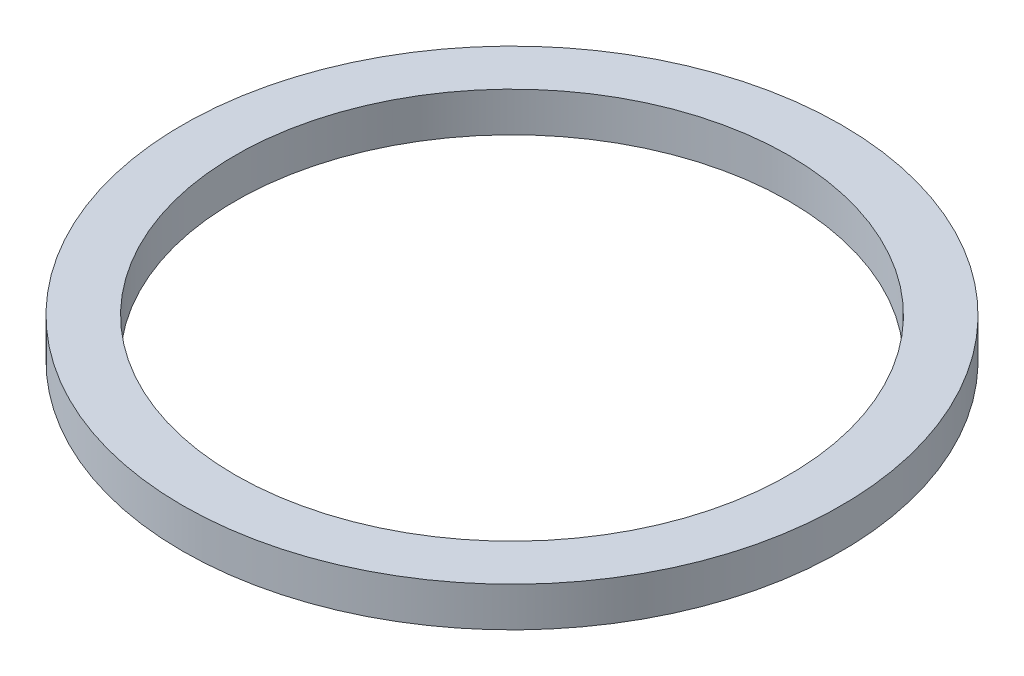
ISO-10303-21;
HEADER;
FILE_DESCRIPTION(('STEP AP214'),'2;1');
FILE_NAME('part.step','',(''),(''),'','','');
FILE_SCHEMA(('AUTOMOTIVE_DESIGN { 1 0 10303 214 1 1 1 1 }'));
ENDSEC;
DATA;
#1=APPLICATION_CONTEXT('core data for automotive mechanical design processes');
#2=APPLICATION_PROTOCOL_DEFINITION('international standard','automotive_design',2000,#1);
#3=PRODUCT_CONTEXT('',#1,'mechanical');
#4=PRODUCT('Part','Part','',(#3));
#5=PRODUCT_RELATED_PRODUCT_CATEGORY('part','',(#4));
#6=PRODUCT_DEFINITION_FORMATION('','',#4);
#7=PRODUCT_DEFINITION_CONTEXT('part definition',#1,'design');
#8=PRODUCT_DEFINITION('design','',#6,#7);
#9=PRODUCT_DEFINITION_SHAPE('','',#8);
#10=(LENGTH_UNIT() NAMED_UNIT(*) SI_UNIT(.MILLI.,.METRE.));
#11=(NAMED_UNIT(*) PLANE_ANGLE_UNIT() SI_UNIT($,.RADIAN.));
#12=(NAMED_UNIT(*) SI_UNIT($,.STERADIAN.) SOLID_ANGLE_UNIT());
#13=UNCERTAINTY_MEASURE_WITH_UNIT(LENGTH_MEASURE(1.E-05),#10,'distance_accuracy_value','');
#14=(GEOMETRIC_REPRESENTATION_CONTEXT(3) GLOBAL_UNCERTAINTY_ASSIGNED_CONTEXT((#13)) GLOBAL_UNIT_ASSIGNED_CONTEXT((#10,
#11,#12)) REPRESENTATION_CONTEXT('',''));
#15=CARTESIAN_POINT('',(0.,0.,0.));
#16=DIRECTION('',(0.,0.,1.));
#17=DIRECTION('',(1.,0.,0.));
#18=AXIS2_PLACEMENT_3D('',#15,#16,#17);
#19=CARTESIAN_POINT('',(0.,3.,0.));
#20=DIRECTION('',(0.,1.,0.));
#21=DIRECTION('',(0.,0.,1.));
#22=AXIS2_PLACEMENT_3D('',#19,#20,#21);
#23=PLANE('',#22);
#24=CARTESIAN_POINT('',(0.,3.,0.));
#25=DIRECTION('',(0.,1.,0.));
#26=DIRECTION('',(0.,0.,1.));
#27=AXIS2_PLACEMENT_3D('',#24,#25,#26);
#28=CIRCLE('',#27,25.);
#29=CARTESIAN_POINT('',(0.,3.,25.));
#30=VERTEX_POINT('',#29);
#31=EDGE_CURVE('E10',#30,#30,#28,.T.);
#32=ORIENTED_EDGE('',*,*,#31,.T.);
#33=EDGE_LOOP('',(#32));
#34=FACE_BOUND('',#33,.T.);
#35=CARTESIAN_POINT('',(0.,3.,0.));
#36=DIRECTION('',(0.,1.,0.));
#37=DIRECTION('',(0.,0.,1.));
#38=AXIS2_PLACEMENT_3D('',#35,#36,#37);
#39=CIRCLE('',#38,21.);
#40=CARTESIAN_POINT('',(0.,3.,21.));
#41=VERTEX_POINT('',#40);
#42=EDGE_CURVE('E41',#41,#41,#39,.T.);
#43=ORIENTED_EDGE('',*,*,#42,.F.);
#44=EDGE_LOOP('',(#43));
#45=FACE_BOUND('',#44,.T.);
#46=ADVANCED_FACE('F30',(#34,#45),#23,.T.);
#47=CARTESIAN_POINT('',(0.,0.,0.));
#48=DIRECTION('',(0.,1.,0.));
#49=DIRECTION('',(0.,0.,1.));
#50=AXIS2_PLACEMENT_3D('',#47,#48,#49);
#51=PLANE('',#50);
#52=CARTESIAN_POINT('',(0.,0.,0.));
#53=DIRECTION('',(0.,1.,0.));
#54=DIRECTION('',(0.,0.,1.));
#55=AXIS2_PLACEMENT_3D('',#52,#53,#54);
#56=CIRCLE('',#55,25.);
#57=CARTESIAN_POINT('',(0.,0.,25.));
#58=VERTEX_POINT('',#57);
#59=EDGE_CURVE('E34',#58,#58,#56,.T.);
#60=ORIENTED_EDGE('',*,*,#59,.F.);
#61=EDGE_LOOP('',(#60));
#62=FACE_BOUND('',#61,.T.);
#63=CARTESIAN_POINT('',(0.,0.,0.));
#64=DIRECTION('',(0.,1.,0.));
#65=DIRECTION('',(0.,0.,1.));
#66=AXIS2_PLACEMENT_3D('',#63,#64,#65);
#67=CIRCLE('',#66,21.);
#68=CARTESIAN_POINT('',(0.,0.,21.));
#69=VERTEX_POINT('',#68);
#70=EDGE_CURVE('E43',#69,#69,#67,.T.);
#71=ORIENTED_EDGE('',*,*,#70,.T.);
#72=EDGE_LOOP('',(#71));
#73=FACE_BOUND('',#72,.T.);
#74=ADVANCED_FACE('F53',(#62,#73),#51,.F.);
#75=CARTESIAN_POINT('',(0.,3.,0.));
#76=DIRECTION('',(0.,-1.,0.));
#77=DIRECTION('',(0.,0.,-1.));
#78=AXIS2_PLACEMENT_3D('',#75,#76,#77);
#79=CYLINDRICAL_SURFACE('',#78,25.);
#80=ORIENTED_EDGE('',*,*,#31,.F.);
#81=EDGE_LOOP('',(#80));
#82=FACE_BOUND('',#81,.T.);
#83=ORIENTED_EDGE('',*,*,#59,.T.);
#84=EDGE_LOOP('',(#83));
#85=FACE_BOUND('',#84,.T.);
#86=ADVANCED_FACE('F32',(#82,#85),#79,.T.);
#87=CARTESIAN_POINT('',(0.,3.,0.));
#88=DIRECTION('',(0.,-1.,0.));
#89=DIRECTION('',(0.,0.,-1.));
#90=AXIS2_PLACEMENT_3D('',#87,#88,#89);
#91=CYLINDRICAL_SURFACE('',#90,21.);
#92=ORIENTED_EDGE('',*,*,#42,.T.);
#93=EDGE_LOOP('',(#92));
#94=FACE_BOUND('',#93,.T.);
#95=ORIENTED_EDGE('',*,*,#70,.F.);
#96=EDGE_LOOP('',(#95));
#97=FACE_BOUND('',#96,.T.);
#98=ADVANCED_FACE('F49',(#94,#97),#91,.F.);
#99=CLOSED_SHELL('',(#46,#74,#86,#98));
#100=MANIFOLD_SOLID_BREP('B2',#99);
#101=ADVANCED_BREP_SHAPE_REPRESENTATION('',(#18,#100),#14);
#102=SHAPE_DEFINITION_REPRESENTATION(#9,#101);
ENDSEC;
END-ISO-10303-21;
